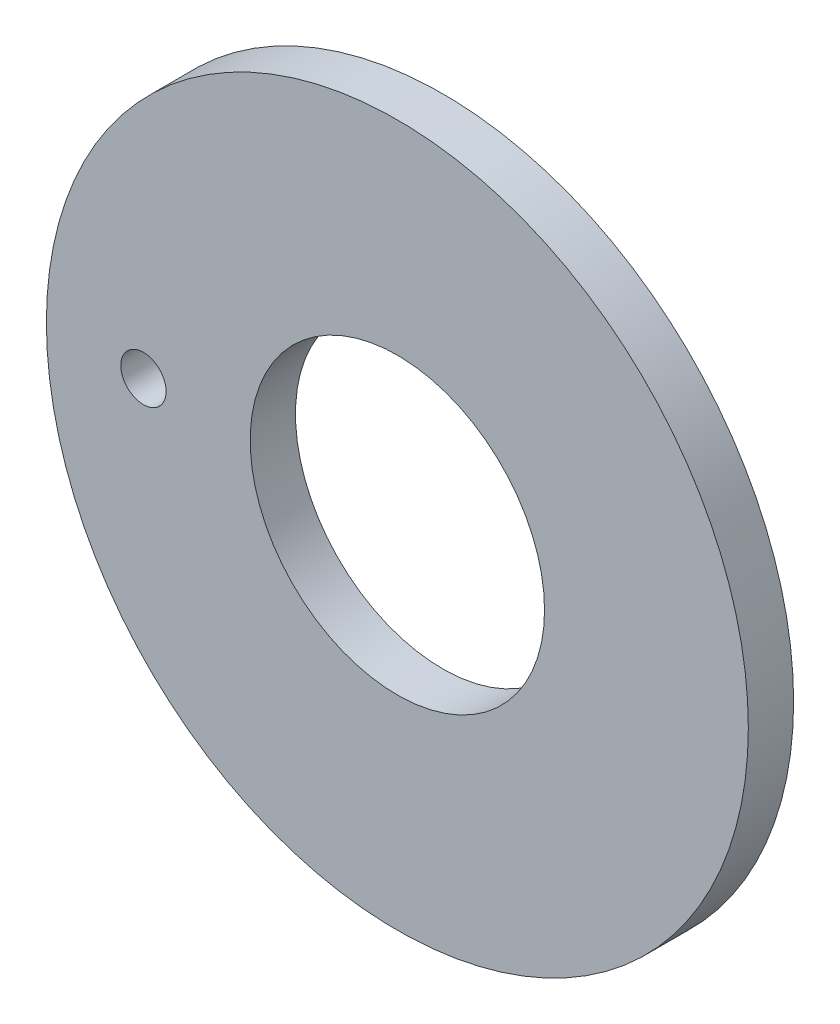
ISO-10303-21;
HEADER;
FILE_DESCRIPTION(('STEP AP214'),'2;1');
FILE_NAME('part.step','',(''),(''),'','','');
FILE_SCHEMA(('AUTOMOTIVE_DESIGN { 1 0 10303 214 1 1 1 1 }'));
ENDSEC;
DATA;
#1=APPLICATION_CONTEXT('core data for automotive mechanical design processes');
#2=APPLICATION_PROTOCOL_DEFINITION('international standard','automotive_design',2000,#1);
#3=PRODUCT_CONTEXT('',#1,'mechanical');
#4=PRODUCT('Part','Part','',(#3));
#5=PRODUCT_RELATED_PRODUCT_CATEGORY('part','',(#4));
#6=PRODUCT_DEFINITION_FORMATION('','',#4);
#7=PRODUCT_DEFINITION_CONTEXT('part definition',#1,'design');
#8=PRODUCT_DEFINITION('design','',#6,#7);
#9=PRODUCT_DEFINITION_SHAPE('','',#8);
#10=(LENGTH_UNIT() NAMED_UNIT(*) SI_UNIT(.MILLI.,.METRE.));
#11=(NAMED_UNIT(*) PLANE_ANGLE_UNIT() SI_UNIT($,.RADIAN.));
#12=(NAMED_UNIT(*) SI_UNIT($,.STERADIAN.) SOLID_ANGLE_UNIT());
#13=UNCERTAINTY_MEASURE_WITH_UNIT(LENGTH_MEASURE(1.E-05),#10,'distance_accuracy_value','');
#14=(GEOMETRIC_REPRESENTATION_CONTEXT(3) GLOBAL_UNCERTAINTY_ASSIGNED_CONTEXT((#13)) GLOBAL_UNIT_ASSIGNED_CONTEXT((#10,
#11,#12)) REPRESENTATION_CONTEXT('',''));
#15=CARTESIAN_POINT('',(0.,0.,0.));
#16=DIRECTION('',(0.,0.,1.));
#17=DIRECTION('',(1.,0.,0.));
#18=AXIS2_PLACEMENT_3D('',#15,#16,#17);
#19=CARTESIAN_POINT('',(0.,0.,6.35));
#20=DIRECTION('',(0.,0.,1.));
#21=DIRECTION('',(1.,0.,0.));
#22=AXIS2_PLACEMENT_3D('',#19,#20,#21);
#23=PLANE('',#22);
#24=CARTESIAN_POINT('',(-35.6017890148196,0.,6.35));
#25=DIRECTION('',(0.,0.,1.));
#26=DIRECTION('',(1.,0.,0.));
#27=AXIS2_PLACEMENT_3D('',#24,#25,#26);
#28=CIRCLE('',#27,3.175);
#29=CARTESIAN_POINT('',(-32.4267890148196,0.,6.35));
#30=VERTEX_POINT('',#29);
#31=EDGE_CURVE('E50',#30,#30,#28,.T.);
#32=ORIENTED_EDGE('',*,*,#31,.F.);
#33=EDGE_LOOP('',(#32));
#34=FACE_BOUND('',#33,.T.);
#35=CARTESIAN_POINT('',(0.,0.,6.35));
#36=DIRECTION('',(0.,0.,1.));
#37=DIRECTION('',(1.,0.,0.));
#38=AXIS2_PLACEMENT_3D('',#35,#36,#37);
#39=CIRCLE('',#38,49.2125);
#40=CARTESIAN_POINT('',(49.2125,0.,6.35));
#41=VERTEX_POINT('',#40);
#42=EDGE_CURVE('E10',#41,#41,#39,.T.);
#43=ORIENTED_EDGE('',*,*,#42,.T.);
#44=EDGE_LOOP('',(#43));
#45=FACE_BOUND('',#44,.T.);
#46=CARTESIAN_POINT('',(0.,0.,6.35));
#47=DIRECTION('',(0.,0.,1.));
#48=DIRECTION('',(1.,0.,0.));
#49=AXIS2_PLACEMENT_3D('',#46,#47,#48);
#50=CIRCLE('',#49,20.6375);
#51=CARTESIAN_POINT('',(20.6375,0.,6.35));
#52=VERTEX_POINT('',#51);
#53=EDGE_CURVE('E56',#52,#52,#50,.T.);
#54=ORIENTED_EDGE('',*,*,#53,.F.);
#55=EDGE_LOOP('',(#54));
#56=FACE_BOUND('',#55,.T.);
#57=ADVANCED_FACE('F37',(#34,#45,#56),#23,.T.);
#58=CARTESIAN_POINT('',(0.,0.,0.));
#59=DIRECTION('',(0.,0.,1.));
#60=DIRECTION('',(1.,0.,0.));
#61=AXIS2_PLACEMENT_3D('',#58,#59,#60);
#62=PLANE('',#61);
#63=CARTESIAN_POINT('',(0.,0.,0.));
#64=DIRECTION('',(0.,0.,1.));
#65=DIRECTION('',(1.,0.,0.));
#66=AXIS2_PLACEMENT_3D('',#63,#64,#65);
#67=CIRCLE('',#66,49.2125);
#68=CARTESIAN_POINT('',(49.2125,0.,0.));
#69=VERTEX_POINT('',#68);
#70=EDGE_CURVE('E41',#69,#69,#67,.T.);
#71=ORIENTED_EDGE('',*,*,#70,.F.);
#72=EDGE_LOOP('',(#71));
#73=FACE_BOUND('',#72,.T.);
#74=CARTESIAN_POINT('',(-35.6017890148196,0.,0.));
#75=DIRECTION('',(0.,0.,1.));
#76=DIRECTION('',(1.,0.,0.));
#77=AXIS2_PLACEMENT_3D('',#74,#75,#76);
#78=CIRCLE('',#77,3.175);
#79=CARTESIAN_POINT('',(-32.4267890148196,0.,0.));
#80=VERTEX_POINT('',#79);
#81=EDGE_CURVE('E52',#80,#80,#78,.T.);
#82=ORIENTED_EDGE('',*,*,#81,.T.);
#83=EDGE_LOOP('',(#82));
#84=FACE_BOUND('',#83,.T.);
#85=CARTESIAN_POINT('',(0.,0.,0.));
#86=DIRECTION('',(0.,0.,1.));
#87=DIRECTION('',(1.,0.,0.));
#88=AXIS2_PLACEMENT_3D('',#85,#86,#87);
#89=CIRCLE('',#88,20.6375);
#90=CARTESIAN_POINT('',(20.6375,0.,0.));
#91=VERTEX_POINT('',#90);
#92=EDGE_CURVE('E60',#91,#91,#89,.T.);
#93=ORIENTED_EDGE('',*,*,#92,.T.);
#94=EDGE_LOOP('',(#93));
#95=FACE_BOUND('',#94,.T.);
#96=ADVANCED_FACE('F72',(#73,#84,#95),#62,.F.);
#97=CARTESIAN_POINT('',(0.,0.,6.35));
#98=DIRECTION('',(0.,0.,-1.));
#99=DIRECTION('',(-1.,0.,0.));
#100=AXIS2_PLACEMENT_3D('',#97,#98,#99);
#101=CYLINDRICAL_SURFACE('',#100,49.2125);
#102=ORIENTED_EDGE('',*,*,#42,.F.);
#103=EDGE_LOOP('',(#102));
#104=FACE_BOUND('',#103,.T.);
#105=ORIENTED_EDGE('',*,*,#70,.T.);
#106=EDGE_LOOP('',(#105));
#107=FACE_BOUND('',#106,.T.);
#108=ADVANCED_FACE('F39',(#104,#107),#101,.T.);
#109=CARTESIAN_POINT('',(-35.6017890148196,0.,6.35));
#110=DIRECTION('',(0.,0.,-1.));
#111=DIRECTION('',(-1.,0.,0.));
#112=AXIS2_PLACEMENT_3D('',#109,#110,#111);
#113=CYLINDRICAL_SURFACE('',#112,3.175);
#114=ORIENTED_EDGE('',*,*,#31,.T.);
#115=EDGE_LOOP('',(#114));
#116=FACE_BOUND('',#115,.T.);
#117=ORIENTED_EDGE('',*,*,#81,.F.);
#118=EDGE_LOOP('',(#117));
#119=FACE_BOUND('',#118,.T.);
#120=ADVANCED_FACE('F81',(#116,#119),#113,.F.);
#121=CARTESIAN_POINT('',(0.,0.,6.35));
#122=DIRECTION('',(0.,0.,-1.));
#123=DIRECTION('',(-1.,0.,0.));
#124=AXIS2_PLACEMENT_3D('',#121,#122,#123);
#125=CYLINDRICAL_SURFACE('',#124,20.6375);
#126=ORIENTED_EDGE('',*,*,#53,.T.);
#127=EDGE_LOOP('',(#126));
#128=FACE_BOUND('',#127,.T.);
#129=ORIENTED_EDGE('',*,*,#92,.F.);
#130=EDGE_LOOP('',(#129));
#131=FACE_BOUND('',#130,.T.);
#132=ADVANCED_FACE('F68',(#128,#131),#125,.F.);
#133=CLOSED_SHELL('',(#57,#96,#108,#120,#132));
#134=MANIFOLD_SOLID_BREP('B2',#133);
#135=ADVANCED_BREP_SHAPE_REPRESENTATION('',(#18,#134),#14);
#136=SHAPE_DEFINITION_REPRESENTATION(#9,#135);
ENDSEC;
END-ISO-10303-21;
